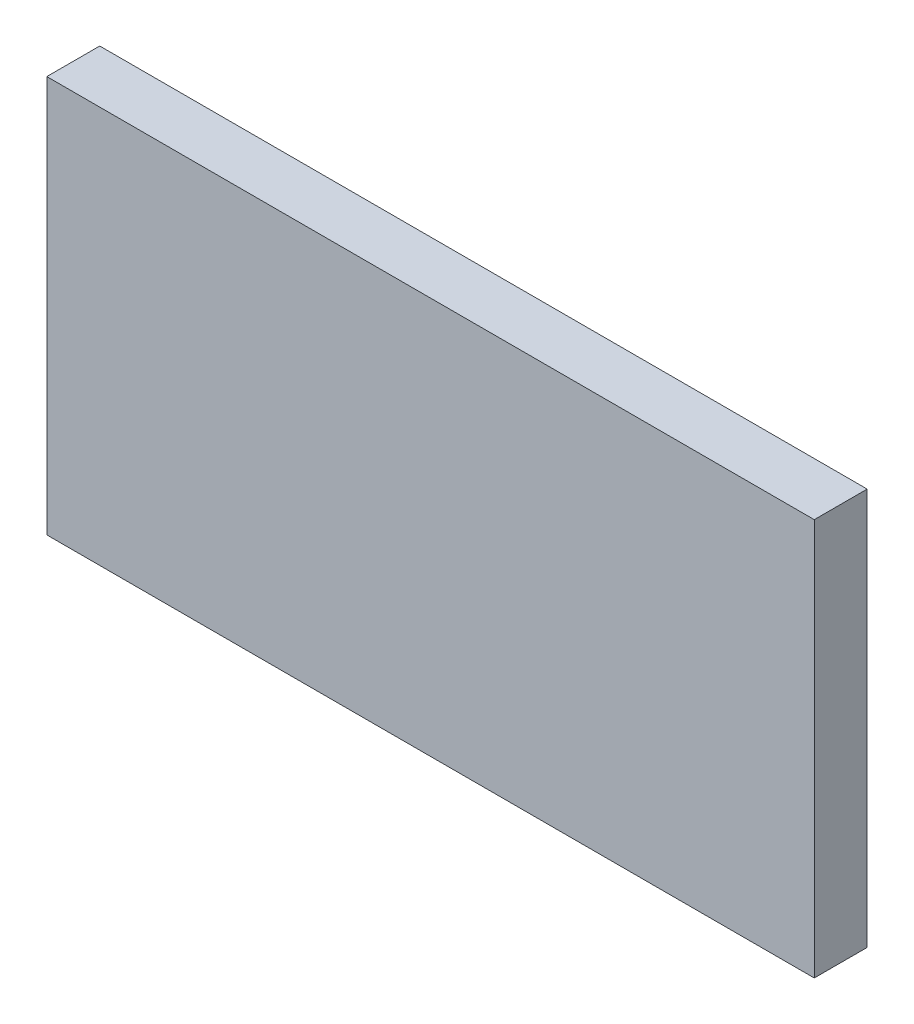
ISO-10303-21;
HEADER;
FILE_DESCRIPTION(('STEP AP214'),'2;1');
FILE_NAME('part.step','',(''),(''),'','','');
FILE_SCHEMA(('AUTOMOTIVE_DESIGN { 1 0 10303 214 1 1 1 1 }'));
ENDSEC;
DATA;
#1=APPLICATION_CONTEXT('core data for automotive mechanical design processes');
#2=APPLICATION_PROTOCOL_DEFINITION('international standard','automotive_design',2000,#1);
#3=PRODUCT_CONTEXT('',#1,'mechanical');
#4=PRODUCT('Part','Part','',(#3));
#5=PRODUCT_RELATED_PRODUCT_CATEGORY('part','',(#4));
#6=PRODUCT_DEFINITION_FORMATION('','',#4);
#7=PRODUCT_DEFINITION_CONTEXT('part definition',#1,'design');
#8=PRODUCT_DEFINITION('design','',#6,#7);
#9=PRODUCT_DEFINITION_SHAPE('','',#8);
#10=(LENGTH_UNIT() NAMED_UNIT(*) SI_UNIT(.MILLI.,.METRE.));
#11=(NAMED_UNIT(*) PLANE_ANGLE_UNIT() SI_UNIT($,.RADIAN.));
#12=(NAMED_UNIT(*) SI_UNIT($,.STERADIAN.) SOLID_ANGLE_UNIT());
#13=UNCERTAINTY_MEASURE_WITH_UNIT(LENGTH_MEASURE(1.E-05),#10,'distance_accuracy_value','');
#14=(GEOMETRIC_REPRESENTATION_CONTEXT(3) GLOBAL_UNCERTAINTY_ASSIGNED_CONTEXT((#13)) GLOBAL_UNIT_ASSIGNED_CONTEXT((#10,
#11,#12)) REPRESENTATION_CONTEXT('',''));
#15=CARTESIAN_POINT('',(0.,0.,0.));
#16=DIRECTION('',(0.,0.,1.));
#17=DIRECTION('',(1.,0.,0.));
#18=AXIS2_PLACEMENT_3D('',#15,#16,#17);
#19=CARTESIAN_POINT('',(-18.649485571611,23.3788546255507,4.));
#20=DIRECTION('',(1.,0.,0.));
#21=DIRECTION('',(0.,1.,0.));
#22=AXIS2_PLACEMENT_3D('',#19,#20,#21);
#23=PLANE('',#22);
#24=DIRECTION('',(0.,-1.,0.));
#25=VECTOR('',#24,1.);
#26=CARTESIAN_POINT('',(-18.649485571611,23.3788546255507,0.));
#27=LINE('',#26,#25);
#28=CARTESIAN_POINT('',(-18.649485571611,23.3788546255507,0.));
#29=VERTEX_POINT('',#28);
#30=CARTESIAN_POINT('',(-18.649485571611,-6.62114537444934,0.));
#31=VERTEX_POINT('',#30);
#32=EDGE_CURVE('E96',#29,#31,#27,.T.);
#33=ORIENTED_EDGE('',*,*,#32,.T.);
#34=DIRECTION('',(0.,0.,-1.));
#35=VECTOR('',#34,1.);
#36=CARTESIAN_POINT('',(-18.649485571611,-6.62114537444934,4.));
#37=LINE('',#36,#35);
#38=CARTESIAN_POINT('',(-18.649485571611,-6.62114537444934,4.));
#39=VERTEX_POINT('',#38);
#40=EDGE_CURVE('E11',#39,#31,#37,.T.);
#41=ORIENTED_EDGE('',*,*,#40,.F.);
#42=DIRECTION('',(0.,-1.,0.));
#43=VECTOR('',#42,1.);
#44=CARTESIAN_POINT('',(-18.649485571611,23.3788546255507,4.));
#45=LINE('',#44,#43);
#46=CARTESIAN_POINT('',(-18.649485571611,23.3788546255507,4.));
#47=VERTEX_POINT('',#46);
#48=EDGE_CURVE('E84',#47,#39,#45,.T.);
#49=ORIENTED_EDGE('',*,*,#48,.F.);
#50=DIRECTION('',(0.,0.,-1.));
#51=VECTOR('',#50,1.);
#52=CARTESIAN_POINT('',(-18.649485571611,23.3788546255507,4.));
#53=LINE('',#52,#51);
#54=EDGE_CURVE('E92',#47,#29,#53,.T.);
#55=ORIENTED_EDGE('',*,*,#54,.T.);
#56=EDGE_LOOP('',(#33,#41,#49,#55));
#57=FACE_BOUND('',#56,.T.);
#58=ADVANCED_FACE('F33',(#57),#23,.F.);
#59=CARTESIAN_POINT('',(-18.649485571611,-6.62114537444934,4.));
#60=DIRECTION('',(0.,1.,0.));
#61=DIRECTION('',(0.,0.,1.));
#62=AXIS2_PLACEMENT_3D('',#59,#60,#61);
#63=PLANE('',#62);
#64=DIRECTION('',(1.,0.,0.));
#65=VECTOR('',#64,1.);
#66=CARTESIAN_POINT('',(-18.649485571611,-6.62114537444934,0.));
#67=LINE('',#66,#65);
#68=CARTESIAN_POINT('',(39.350514428389,-6.62114537444934,0.));
#69=VERTEX_POINT('',#68);
#70=EDGE_CURVE('E88',#31,#69,#67,.T.);
#71=ORIENTED_EDGE('',*,*,#70,.T.);
#72=DIRECTION('',(0.,0.,-1.));
#73=VECTOR('',#72,1.);
#74=CARTESIAN_POINT('',(39.350514428389,-6.62114537444934,4.));
#75=LINE('',#74,#73);
#76=CARTESIAN_POINT('',(39.350514428389,-6.62114537444934,4.));
#77=VERTEX_POINT('',#76);
#78=EDGE_CURVE('E41',#77,#69,#75,.T.);
#79=ORIENTED_EDGE('',*,*,#78,.F.);
#80=DIRECTION('',(1.,0.,0.));
#81=VECTOR('',#80,1.);
#82=CARTESIAN_POINT('',(-18.649485571611,-6.62114537444934,4.));
#83=LINE('',#82,#81);
#84=EDGE_CURVE('E79',#39,#77,#83,.T.);
#85=ORIENTED_EDGE('',*,*,#84,.F.);
#86=ORIENTED_EDGE('',*,*,#40,.T.);
#87=EDGE_LOOP('',(#71,#79,#85,#86));
#88=FACE_BOUND('',#87,.T.);
#89=ADVANCED_FACE('F87',(#88),#63,.F.);
#90=CARTESIAN_POINT('',(39.350514428389,23.3788546255507,4.));
#91=DIRECTION('',(-1.,0.,0.));
#92=DIRECTION('',(0.,0.,1.));
#93=AXIS2_PLACEMENT_3D('',#90,#91,#92);
#94=PLANE('',#93);
#95=DIRECTION('',(0.,1.,0.));
#96=VECTOR('',#95,1.);
#97=CARTESIAN_POINT('',(39.350514428389,23.3788546255507,0.));
#98=LINE('',#97,#96);
#99=CARTESIAN_POINT('',(39.350514428389,23.3788546255507,0.));
#100=VERTEX_POINT('',#99);
#101=EDGE_CURVE('E66',#69,#100,#98,.T.);
#102=ORIENTED_EDGE('',*,*,#101,.T.);
#103=DIRECTION('',(0.,0.,-1.));
#104=VECTOR('',#103,1.);
#105=CARTESIAN_POINT('',(39.350514428389,23.3788546255507,4.));
#106=LINE('',#105,#104);
#107=CARTESIAN_POINT('',(39.350514428389,23.3788546255507,4.));
#108=VERTEX_POINT('',#107);
#109=EDGE_CURVE('E89',#108,#100,#106,.T.);
#110=ORIENTED_EDGE('',*,*,#109,.F.);
#111=DIRECTION('',(0.,1.,0.));
#112=VECTOR('',#111,1.);
#113=CARTESIAN_POINT('',(39.350514428389,23.3788546255507,4.));
#114=LINE('',#113,#112);
#115=EDGE_CURVE('E82',#77,#108,#114,.T.);
#116=ORIENTED_EDGE('',*,*,#115,.F.);
#117=ORIENTED_EDGE('',*,*,#78,.T.);
#118=EDGE_LOOP('',(#102,#110,#116,#117));
#119=FACE_BOUND('',#118,.T.);
#120=ADVANCED_FACE('F90',(#119),#94,.F.);
#121=CARTESIAN_POINT('',(-18.649485571611,23.3788546255507,4.));
#122=DIRECTION('',(0.,-1.,0.));
#123=DIRECTION('',(0.,0.,-1.));
#124=AXIS2_PLACEMENT_3D('',#121,#122,#123);
#125=PLANE('',#124);
#126=DIRECTION('',(-1.,0.,0.));
#127=VECTOR('',#126,1.);
#128=CARTESIAN_POINT('',(-18.649485571611,23.3788546255507,0.));
#129=LINE('',#128,#127);
#130=EDGE_CURVE('E72',#100,#29,#129,.T.);
#131=ORIENTED_EDGE('',*,*,#130,.T.);
#132=ORIENTED_EDGE('',*,*,#54,.F.);
#133=DIRECTION('',(-1.,0.,0.));
#134=VECTOR('',#133,1.);
#135=CARTESIAN_POINT('',(-18.649485571611,23.3788546255507,4.));
#136=LINE('',#135,#134);
#137=EDGE_CURVE('E49',#108,#47,#136,.T.);
#138=ORIENTED_EDGE('',*,*,#137,.F.);
#139=ORIENTED_EDGE('',*,*,#109,.T.);
#140=EDGE_LOOP('',(#131,#132,#138,#139));
#141=FACE_BOUND('',#140,.T.);
#142=ADVANCED_FACE('F103',(#141),#125,.F.);
#143=CARTESIAN_POINT('',(0.,0.,4.));
#144=DIRECTION('',(0.,0.,1.));
#145=DIRECTION('',(1.,0.,0.));
#146=AXIS2_PLACEMENT_3D('',#143,#144,#145);
#147=PLANE('',#146);
#148=ORIENTED_EDGE('',*,*,#48,.T.);
#149=ORIENTED_EDGE('',*,*,#84,.T.);
#150=ORIENTED_EDGE('',*,*,#115,.T.);
#151=ORIENTED_EDGE('',*,*,#137,.T.);
#152=EDGE_LOOP('',(#148,#149,#150,#151));
#153=FACE_BOUND('',#152,.T.);
#154=ADVANCED_FACE('F80',(#153),#147,.T.);
#155=CARTESIAN_POINT('',(0.,0.,0.));
#156=DIRECTION('',(0.,0.,1.));
#157=DIRECTION('',(1.,0.,0.));
#158=AXIS2_PLACEMENT_3D('',#155,#156,#157);
#159=PLANE('',#158);
#160=ORIENTED_EDGE('',*,*,#32,.F.);
#161=ORIENTED_EDGE('',*,*,#130,.F.);
#162=ORIENTED_EDGE('',*,*,#101,.F.);
#163=ORIENTED_EDGE('',*,*,#70,.F.);
#164=EDGE_LOOP('',(#160,#161,#162,#163));
#165=FACE_BOUND('',#164,.T.);
#166=ADVANCED_FACE('F106',(#165),#159,.F.);
#167=CLOSED_SHELL('',(#58,#89,#120,#142,#154,#166));
#168=MANIFOLD_SOLID_BREP('B2',#167);
#169=ADVANCED_BREP_SHAPE_REPRESENTATION('',(#18,#168),#14);
#170=SHAPE_DEFINITION_REPRESENTATION(#9,#169);
ENDSEC;
END-ISO-10303-21;
